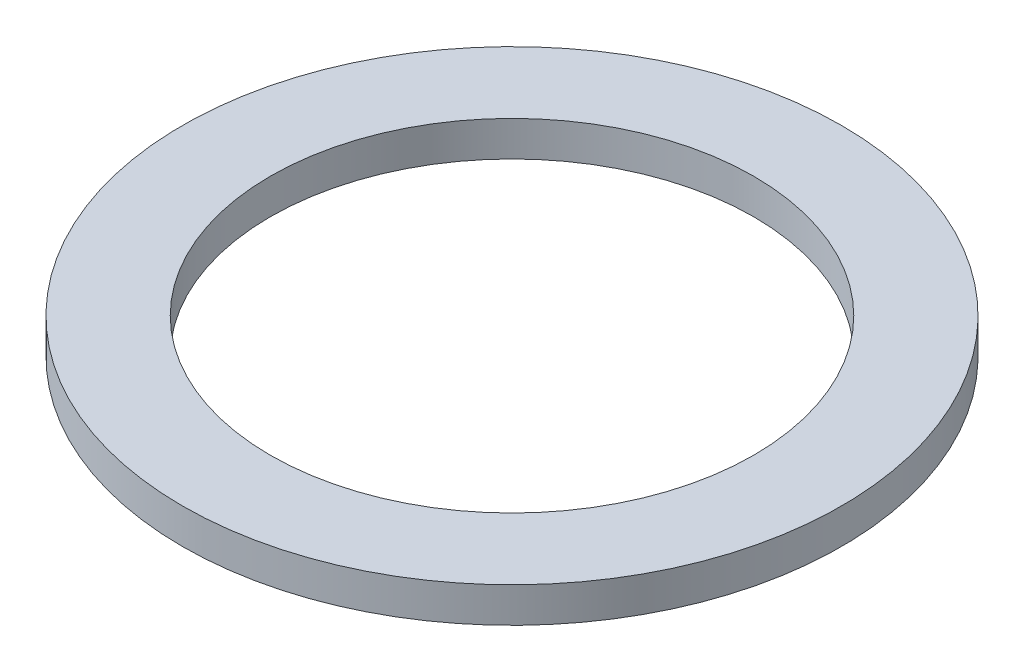
ISO-10303-21;
HEADER;
FILE_DESCRIPTION(('STEP AP214'),'2;1');
FILE_NAME('part.step','',(''),(''),'','','');
FILE_SCHEMA(('AUTOMOTIVE_DESIGN { 1 0 10303 214 1 1 1 1 }'));
ENDSEC;
DATA;
#1=APPLICATION_CONTEXT('core data for automotive mechanical design processes');
#2=APPLICATION_PROTOCOL_DEFINITION('international standard','automotive_design',2000,#1);
#3=PRODUCT_CONTEXT('',#1,'mechanical');
#4=PRODUCT('Part','Part','',(#3));
#5=PRODUCT_RELATED_PRODUCT_CATEGORY('part','',(#4));
#6=PRODUCT_DEFINITION_FORMATION('','',#4);
#7=PRODUCT_DEFINITION_CONTEXT('part definition',#1,'design');
#8=PRODUCT_DEFINITION('design','',#6,#7);
#9=PRODUCT_DEFINITION_SHAPE('','',#8);
#10=(LENGTH_UNIT() NAMED_UNIT(*) SI_UNIT(.MILLI.,.METRE.));
#11=(NAMED_UNIT(*) PLANE_ANGLE_UNIT() SI_UNIT($,.RADIAN.));
#12=(NAMED_UNIT(*) SI_UNIT($,.STERADIAN.) SOLID_ANGLE_UNIT());
#13=UNCERTAINTY_MEASURE_WITH_UNIT(LENGTH_MEASURE(1.E-05),#10,'distance_accuracy_value','');
#14=(GEOMETRIC_REPRESENTATION_CONTEXT(3) GLOBAL_UNCERTAINTY_ASSIGNED_CONTEXT((#13)) GLOBAL_UNIT_ASSIGNED_CONTEXT((#10,
#11,#12)) REPRESENTATION_CONTEXT('',''));
#15=CARTESIAN_POINT('',(0.,0.,0.));
#16=DIRECTION('',(0.,0.,1.));
#17=DIRECTION('',(1.,0.,0.));
#18=AXIS2_PLACEMENT_3D('',#15,#16,#17);
#19=CARTESIAN_POINT('',(0.,4.,0.));
#20=DIRECTION('',(0.,-1.,0.));
#21=DIRECTION('',(0.,0.,-1.));
#22=AXIS2_PLACEMENT_3D('',#19,#20,#21);
#23=CYLINDRICAL_SURFACE('',#22,37.5);
#24=CARTESIAN_POINT('',(0.,4.,0.));
#25=DIRECTION('',(0.,1.,0.));
#26=DIRECTION('',(0.,0.,1.));
#27=AXIS2_PLACEMENT_3D('',#24,#25,#26);
#28=CIRCLE('',#27,37.5);
#29=CARTESIAN_POINT('',(0.,4.,37.5));
#30=VERTEX_POINT('',#29);
#31=EDGE_CURVE('E10',#30,#30,#28,.T.);
#32=ORIENTED_EDGE('',*,*,#31,.F.);
#33=EDGE_LOOP('',(#32));
#34=FACE_BOUND('',#33,.T.);
#35=CARTESIAN_POINT('',(0.,0.,0.));
#36=DIRECTION('',(0.,1.,0.));
#37=DIRECTION('',(0.,0.,1.));
#38=AXIS2_PLACEMENT_3D('',#35,#36,#37);
#39=CIRCLE('',#38,37.5);
#40=CARTESIAN_POINT('',(0.,0.,37.5));
#41=VERTEX_POINT('',#40);
#42=EDGE_CURVE('E37',#41,#41,#39,.T.);
#43=ORIENTED_EDGE('',*,*,#42,.T.);
#44=EDGE_LOOP('',(#43));
#45=FACE_BOUND('',#44,.T.);
#46=ADVANCED_FACE('F40',(#34,#45),#23,.T.);
#47=CARTESIAN_POINT('',(0.,4.,0.));
#48=DIRECTION('',(0.,1.,0.));
#49=DIRECTION('',(0.,0.,1.));
#50=AXIS2_PLACEMENT_3D('',#47,#48,#49);
#51=PLANE('',#50);
#52=CARTESIAN_POINT('',(0.,4.,0.));
#53=DIRECTION('',(0.,1.,0.));
#54=DIRECTION('',(0.,0.,1.));
#55=AXIS2_PLACEMENT_3D('',#52,#53,#54);
#56=CIRCLE('',#55,27.5);
#57=CARTESIAN_POINT('',(0.,4.,27.5));
#58=VERTEX_POINT('',#57);
#59=EDGE_CURVE('E50',#58,#58,#56,.T.);
#60=ORIENTED_EDGE('',*,*,#59,.F.);
#61=EDGE_LOOP('',(#60));
#62=FACE_BOUND('',#61,.T.);
#63=ORIENTED_EDGE('',*,*,#31,.T.);
#64=EDGE_LOOP('',(#63));
#65=FACE_BOUND('',#64,.T.);
#66=ADVANCED_FACE('F59',(#62,#65),#51,.T.);
#67=CARTESIAN_POINT('',(0.,0.,0.));
#68=DIRECTION('',(0.,1.,0.));
#69=DIRECTION('',(0.,0.,1.));
#70=AXIS2_PLACEMENT_3D('',#67,#68,#69);
#71=PLANE('',#70);
#72=CARTESIAN_POINT('',(0.,0.,0.));
#73=DIRECTION('',(0.,1.,0.));
#74=DIRECTION('',(0.,0.,1.));
#75=AXIS2_PLACEMENT_3D('',#72,#73,#74);
#76=CIRCLE('',#75,27.5);
#77=CARTESIAN_POINT('',(0.,0.,27.5));
#78=VERTEX_POINT('',#77);
#79=EDGE_CURVE('E47',#78,#78,#76,.T.);
#80=ORIENTED_EDGE('',*,*,#79,.T.);
#81=EDGE_LOOP('',(#80));
#82=FACE_BOUND('',#81,.T.);
#83=ORIENTED_EDGE('',*,*,#42,.F.);
#84=EDGE_LOOP('',(#83));
#85=FACE_BOUND('',#84,.T.);
#86=ADVANCED_FACE('F58',(#82,#85),#71,.F.);
#87=CARTESIAN_POINT('',(0.,4.,0.));
#88=DIRECTION('',(0.,-1.,0.));
#89=DIRECTION('',(0.,0.,-1.));
#90=AXIS2_PLACEMENT_3D('',#87,#88,#89);
#91=CYLINDRICAL_SURFACE('',#90,27.5);
#92=ORIENTED_EDGE('',*,*,#59,.T.);
#93=EDGE_LOOP('',(#92));
#94=FACE_BOUND('',#93,.T.);
#95=ORIENTED_EDGE('',*,*,#79,.F.);
#96=EDGE_LOOP('',(#95));
#97=FACE_BOUND('',#96,.T.);
#98=ADVANCED_FACE('F54',(#94,#97),#91,.F.);
#99=CLOSED_SHELL('',(#46,#66,#86,#98));
#100=MANIFOLD_SOLID_BREP('B2',#99);
#101=ADVANCED_BREP_SHAPE_REPRESENTATION('',(#18,#100),#14);
#102=SHAPE_DEFINITION_REPRESENTATION(#9,#101);
ENDSEC;
END-ISO-10303-21;
